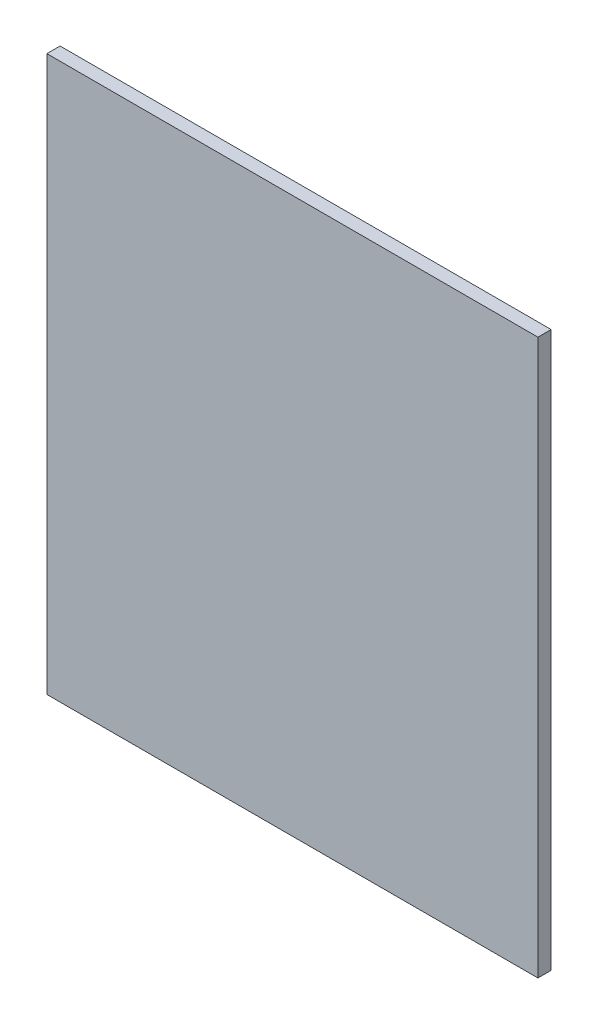
ISO-10303-21;
HEADER;
FILE_DESCRIPTION(('STEP AP214'),'2;1');
FILE_NAME('part.step','',(''),(''),'','','');
FILE_SCHEMA(('AUTOMOTIVE_DESIGN { 1 0 10303 214 1 1 1 1 }'));
ENDSEC;
DATA;
#1=APPLICATION_CONTEXT('core data for automotive mechanical design processes');
#2=APPLICATION_PROTOCOL_DEFINITION('international standard','automotive_design',2000,#1);
#3=PRODUCT_CONTEXT('',#1,'mechanical');
#4=PRODUCT('Part','Part','',(#3));
#5=PRODUCT_RELATED_PRODUCT_CATEGORY('part','',(#4));
#6=PRODUCT_DEFINITION_FORMATION('','',#4);
#7=PRODUCT_DEFINITION_CONTEXT('part definition',#1,'design');
#8=PRODUCT_DEFINITION('design','',#6,#7);
#9=PRODUCT_DEFINITION_SHAPE('','',#8);
#10=(LENGTH_UNIT() NAMED_UNIT(*) SI_UNIT(.MILLI.,.METRE.));
#11=(NAMED_UNIT(*) PLANE_ANGLE_UNIT() SI_UNIT($,.RADIAN.));
#12=(NAMED_UNIT(*) SI_UNIT($,.STERADIAN.) SOLID_ANGLE_UNIT());
#13=UNCERTAINTY_MEASURE_WITH_UNIT(LENGTH_MEASURE(1.E-05),#10,'distance_accuracy_value','');
#14=(GEOMETRIC_REPRESENTATION_CONTEXT(3) GLOBAL_UNCERTAINTY_ASSIGNED_CONTEXT((#13)) GLOBAL_UNIT_ASSIGNED_CONTEXT((#10,
#11,#12)) REPRESENTATION_CONTEXT('',''));
#15=CARTESIAN_POINT('',(0.,0.,0.));
#16=DIRECTION('',(0.,0.,1.));
#17=DIRECTION('',(1.,0.,0.));
#18=AXIS2_PLACEMENT_3D('',#15,#16,#17);
#19=CARTESIAN_POINT('',(0.,213.338890988595,2.54));
#20=DIRECTION('',(0.,-1.,0.));
#21=DIRECTION('',(1.,0.,0.));
#22=AXIS2_PLACEMENT_3D('',#19,#20,#21);
#23=PLANE('',#22);
#24=DIRECTION('',(-1.,0.,0.));
#25=VECTOR('',#24,1.);
#26=CARTESIAN_POINT('',(0.,213.338890988595,-2.54));
#27=LINE('',#26,#25);
#28=CARTESIAN_POINT('',(0.,213.338890988595,-2.54));
#29=VERTEX_POINT('',#28);
#30=CARTESIAN_POINT('',(-188.766100340605,213.338890988595,-2.54));
#31=VERTEX_POINT('',#30);
#32=EDGE_CURVE('E100',#29,#31,#27,.T.);
#33=ORIENTED_EDGE('',*,*,#32,.T.);
#34=DIRECTION('',(0.,0.,-1.));
#35=VECTOR('',#34,1.);
#36=CARTESIAN_POINT('',(-188.766100340605,213.338890988595,2.54));
#37=LINE('',#36,#35);
#38=CARTESIAN_POINT('',(-188.766100340605,213.338890988595,2.54));
#39=VERTEX_POINT('',#38);
#40=EDGE_CURVE('E11',#39,#31,#37,.T.);
#41=ORIENTED_EDGE('',*,*,#40,.F.);
#42=DIRECTION('',(-1.,0.,0.));
#43=VECTOR('',#42,1.);
#44=CARTESIAN_POINT('',(0.,213.338890988595,2.54));
#45=LINE('',#44,#43);
#46=CARTESIAN_POINT('',(0.,213.338890988595,2.54));
#47=VERTEX_POINT('',#46);
#48=EDGE_CURVE('E88',#47,#39,#45,.T.);
#49=ORIENTED_EDGE('',*,*,#48,.F.);
#50=DIRECTION('',(0.,0.,-1.));
#51=VECTOR('',#50,1.);
#52=CARTESIAN_POINT('',(0.,213.338890988595,2.54));
#53=LINE('',#52,#51);
#54=EDGE_CURVE('E96',#47,#29,#53,.T.);
#55=ORIENTED_EDGE('',*,*,#54,.T.);
#56=EDGE_LOOP('',(#33,#41,#49,#55));
#57=FACE_BOUND('',#56,.T.);
#58=ADVANCED_FACE('F37',(#57),#23,.F.);
#59=CARTESIAN_POINT('',(-188.766100340605,213.338890988595,2.54));
#60=DIRECTION('',(1.,0.,0.));
#61=DIRECTION('',(0.,1.,0.));
#62=AXIS2_PLACEMENT_3D('',#59,#60,#61);
#63=PLANE('',#62);
#64=DIRECTION('',(0.,-1.,0.));
#65=VECTOR('',#64,1.);
#66=CARTESIAN_POINT('',(-188.766100340605,213.338890988595,-2.54));
#67=LINE('',#66,#65);
#68=CARTESIAN_POINT('',(-188.766100340605,0.,-2.54));
#69=VERTEX_POINT('',#68);
#70=EDGE_CURVE('E92',#31,#69,#67,.T.);
#71=ORIENTED_EDGE('',*,*,#70,.T.);
#72=DIRECTION('',(0.,0.,-1.));
#73=VECTOR('',#72,1.);
#74=CARTESIAN_POINT('',(-188.766100340605,0.,2.54));
#75=LINE('',#74,#73);
#76=CARTESIAN_POINT('',(-188.766100340605,0.,2.54));
#77=VERTEX_POINT('',#76);
#78=EDGE_CURVE('E45',#77,#69,#75,.T.);
#79=ORIENTED_EDGE('',*,*,#78,.F.);
#80=DIRECTION('',(0.,-1.,0.));
#81=VECTOR('',#80,1.);
#82=CARTESIAN_POINT('',(-188.766100340605,213.338890988595,2.54));
#83=LINE('',#82,#81);
#84=EDGE_CURVE('E83',#39,#77,#83,.T.);
#85=ORIENTED_EDGE('',*,*,#84,.F.);
#86=ORIENTED_EDGE('',*,*,#40,.T.);
#87=EDGE_LOOP('',(#71,#79,#85,#86));
#88=FACE_BOUND('',#87,.T.);
#89=ADVANCED_FACE('F91',(#88),#63,.F.);
#90=CARTESIAN_POINT('',(-188.766100340605,0.,2.54));
#91=DIRECTION('',(0.,1.,0.));
#92=DIRECTION('',(0.,0.,1.));
#93=AXIS2_PLACEMENT_3D('',#90,#91,#92);
#94=PLANE('',#93);
#95=DIRECTION('',(1.,0.,0.));
#96=VECTOR('',#95,1.);
#97=CARTESIAN_POINT('',(-188.766100340605,0.,-2.54));
#98=LINE('',#97,#96);
#99=CARTESIAN_POINT('',(0.,0.,-2.54));
#100=VERTEX_POINT('',#99);
#101=EDGE_CURVE('E70',#69,#100,#98,.T.);
#102=ORIENTED_EDGE('',*,*,#101,.T.);
#103=DIRECTION('',(0.,0.,-1.));
#104=VECTOR('',#103,1.);
#105=CARTESIAN_POINT('',(0.,0.,2.54));
#106=LINE('',#105,#104);
#107=CARTESIAN_POINT('',(0.,0.,2.54));
#108=VERTEX_POINT('',#107);
#109=EDGE_CURVE('E93',#108,#100,#106,.T.);
#110=ORIENTED_EDGE('',*,*,#109,.F.);
#111=DIRECTION('',(1.,0.,0.));
#112=VECTOR('',#111,1.);
#113=CARTESIAN_POINT('',(-188.766100340605,0.,2.54));
#114=LINE('',#113,#112);
#115=EDGE_CURVE('E86',#77,#108,#114,.T.);
#116=ORIENTED_EDGE('',*,*,#115,.F.);
#117=ORIENTED_EDGE('',*,*,#78,.T.);
#118=EDGE_LOOP('',(#102,#110,#116,#117));
#119=FACE_BOUND('',#118,.T.);
#120=ADVANCED_FACE('F94',(#119),#94,.F.);
#121=CARTESIAN_POINT('',(0.,0.,2.54));
#122=DIRECTION('',(-1.,0.,0.));
#123=DIRECTION('',(0.,0.,1.));
#124=AXIS2_PLACEMENT_3D('',#121,#122,#123);
#125=PLANE('',#124);
#126=DIRECTION('',(0.,1.,0.));
#127=VECTOR('',#126,1.);
#128=CARTESIAN_POINT('',(0.,0.,-2.54));
#129=LINE('',#128,#127);
#130=EDGE_CURVE('E76',#100,#29,#129,.T.);
#131=ORIENTED_EDGE('',*,*,#130,.T.);
#132=ORIENTED_EDGE('',*,*,#54,.F.);
#133=DIRECTION('',(0.,1.,0.));
#134=VECTOR('',#133,1.);
#135=CARTESIAN_POINT('',(0.,0.,2.54));
#136=LINE('',#135,#134);
#137=EDGE_CURVE('E53',#108,#47,#136,.T.);
#138=ORIENTED_EDGE('',*,*,#137,.F.);
#139=ORIENTED_EDGE('',*,*,#109,.T.);
#140=EDGE_LOOP('',(#131,#132,#138,#139));
#141=FACE_BOUND('',#140,.T.);
#142=ADVANCED_FACE('F107',(#141),#125,.F.);
#143=CARTESIAN_POINT('',(0.,0.,2.54));
#144=DIRECTION('',(0.,0.,1.));
#145=DIRECTION('',(1.,0.,0.));
#146=AXIS2_PLACEMENT_3D('',#143,#144,#145);
#147=PLANE('',#146);
#148=ORIENTED_EDGE('',*,*,#48,.T.);
#149=ORIENTED_EDGE('',*,*,#84,.T.);
#150=ORIENTED_EDGE('',*,*,#115,.T.);
#151=ORIENTED_EDGE('',*,*,#137,.T.);
#152=EDGE_LOOP('',(#148,#149,#150,#151));
#153=FACE_BOUND('',#152,.T.);
#154=ADVANCED_FACE('F84',(#153),#147,.T.);
#155=CARTESIAN_POINT('',(0.,0.,-2.54));
#156=DIRECTION('',(0.,0.,1.));
#157=DIRECTION('',(1.,0.,0.));
#158=AXIS2_PLACEMENT_3D('',#155,#156,#157);
#159=PLANE('',#158);
#160=ORIENTED_EDGE('',*,*,#32,.F.);
#161=ORIENTED_EDGE('',*,*,#130,.F.);
#162=ORIENTED_EDGE('',*,*,#101,.F.);
#163=ORIENTED_EDGE('',*,*,#70,.F.);
#164=EDGE_LOOP('',(#160,#161,#162,#163));
#165=FACE_BOUND('',#164,.T.);
#166=ADVANCED_FACE('F110',(#165),#159,.F.);
#167=CLOSED_SHELL('',(#58,#89,#120,#142,#154,#166));
#168=MANIFOLD_SOLID_BREP('B2',#167);
#169=ADVANCED_BREP_SHAPE_REPRESENTATION('',(#18,#168),#14);
#170=SHAPE_DEFINITION_REPRESENTATION(#9,#169);
ENDSEC;
END-ISO-10303-21;
